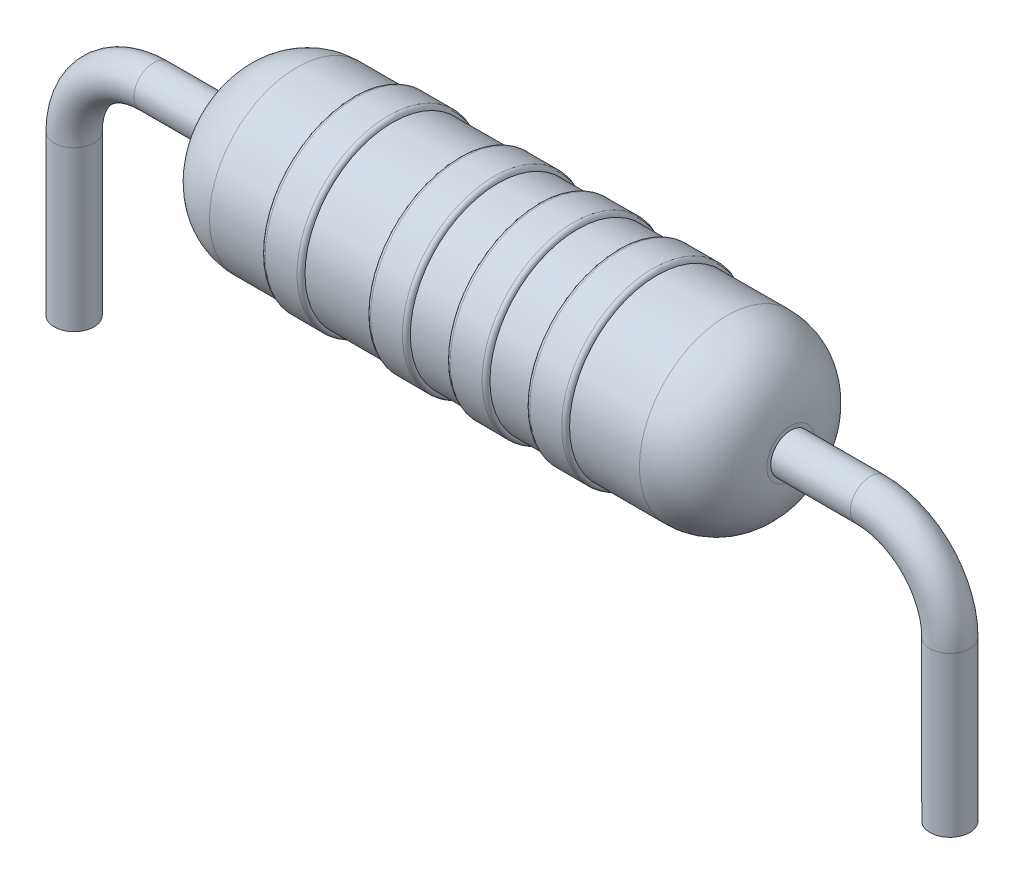
ISO-10303-21;
HEADER;
FILE_DESCRIPTION(('STEP AP214'),'2;1');
FILE_NAME('part.step','',(''),(''),'','','');
FILE_SCHEMA(('AUTOMOTIVE_DESIGN { 1 0 10303 214 1 1 1 1 }'));
ENDSEC;
DATA;
#1=APPLICATION_CONTEXT('core data for automotive mechanical design processes');
#2=APPLICATION_PROTOCOL_DEFINITION('international standard','automotive_design',2000,#1);
#3=PRODUCT_CONTEXT('',#1,'mechanical');
#4=PRODUCT('Part','Part','',(#3));
#5=PRODUCT_RELATED_PRODUCT_CATEGORY('part','',(#4));
#6=PRODUCT_DEFINITION_FORMATION('','',#4);
#7=PRODUCT_DEFINITION_CONTEXT('part definition',#1,'design');
#8=PRODUCT_DEFINITION('design','',#6,#7);
#9=PRODUCT_DEFINITION_SHAPE('','',#8);
#10=(LENGTH_UNIT() NAMED_UNIT(*) SI_UNIT(.MILLI.,.METRE.));
#11=(NAMED_UNIT(*) PLANE_ANGLE_UNIT() SI_UNIT($,.RADIAN.));
#12=(NAMED_UNIT(*) SI_UNIT($,.STERADIAN.) SOLID_ANGLE_UNIT());
#13=UNCERTAINTY_MEASURE_WITH_UNIT(LENGTH_MEASURE(1.E-05),#10,'distance_accuracy_value','');
#14=(GEOMETRIC_REPRESENTATION_CONTEXT(3) GLOBAL_UNCERTAINTY_ASSIGNED_CONTEXT((#13)) GLOBAL_UNIT_ASSIGNED_CONTEXT((#10,
#11,#12)) REPRESENTATION_CONTEXT('',''));
#15=CARTESIAN_POINT('',(0.,0.,0.));
#16=DIRECTION('',(0.,0.,1.));
#17=DIRECTION('',(1.,0.,0.));
#18=AXIS2_PLACEMENT_3D('',#15,#16,#17);
#19=CARTESIAN_POINT('',(-3.5,0.,0.));
#20=DIRECTION('',(1.,0.,0.));
#21=DIRECTION('',(0.,0.,-1.));
#22=AXIS2_PLACEMENT_3D('',#19,#20,#21);
#23=PLANE('',#22);
#24=CARTESIAN_POINT('',(-3.5,0.,0.));
#25=DIRECTION('',(-1.,0.,0.));
#26=DIRECTION('',(0.,0.,1.));
#27=AXIS2_PLACEMENT_3D('',#24,#25,#26);
#28=CIRCLE('',#27,0.299999999999995);
#29=CARTESIAN_POINT('',(-3.5,0.,0.299999999999995));
#30=VERTEX_POINT('',#29);
#31=EDGE_CURVE('E91',#30,#30,#28,.T.);
#32=ORIENTED_EDGE('',*,*,#31,.T.);
#33=EDGE_LOOP('',(#32));
#34=FACE_BOUND('',#33,.T.);
#35=CARTESIAN_POINT('',(-3.5,0.,0.));
#36=DIRECTION('',(1.,0.,0.));
#37=DIRECTION('',(0.,0.,-1.));
#38=AXIS2_PLACEMENT_3D('',#35,#36,#37);
#39=CIRCLE('',#38,0.25);
#40=CARTESIAN_POINT('',(-3.5,0.,-0.25));
#41=VERTEX_POINT('',#40);
#42=EDGE_CURVE('E10',#41,#41,#39,.F.);
#43=ORIENTED_EDGE('',*,*,#42,.F.);
#44=EDGE_LOOP('',(#43));
#45=FACE_BOUND('',#44,.T.);
#46=ADVANCED_FACE('F32',(#34,#45),#23,.F.);
#47=CARTESIAN_POINT('',(-54.2686615886834,0.,0.));
#48=DIRECTION('',(-1.,0.,0.));
#49=DIRECTION('',(0.,0.,1.));
#50=AXIS2_PLACEMENT_3D('',#47,#48,#49);
#51=CYLINDRICAL_SURFACE('',#50,1.1);
#52=CARTESIAN_POINT('',(0.322975145638588,0.,0.));
#53=DIRECTION('',(-1.,0.,0.));
#54=DIRECTION('',(0.,0.,1.));
#55=AXIS2_PLACEMENT_3D('',#52,#53,#54);
#56=CIRCLE('',#55,1.1);
#57=CARTESIAN_POINT('',(0.322975145638588,0.,1.1));
#58=VERTEX_POINT('',#57);
#59=EDGE_CURVE('E79',#58,#58,#56,.T.);
#60=ORIENTED_EDGE('',*,*,#59,.T.);
#61=EDGE_LOOP('',(#60));
#62=FACE_BOUND('',#61,.T.);
#63=CARTESIAN_POINT('',(-0.177024854361413,0.,0.));
#64=DIRECTION('',(1.,0.,0.));
#65=DIRECTION('',(0.,0.,-1.));
#66=AXIS2_PLACEMENT_3D('',#63,#64,#65);
#67=CIRCLE('',#66,1.1);
#68=CARTESIAN_POINT('',(-0.177024854361413,0.,-1.1));
#69=VERTEX_POINT('',#68);
#70=EDGE_CURVE('E88',#69,#69,#67,.T.);
#71=ORIENTED_EDGE('',*,*,#70,.T.);
#72=EDGE_LOOP('',(#71));
#73=FACE_BOUND('',#72,.T.);
#74=ADVANCED_FACE('F149',(#62,#73),#51,.T.);
#75=CARTESIAN_POINT('',(4.3261723446646,0.,0.));
#76=DIRECTION('',(1.,0.,0.));
#77=DIRECTION('',(0.,0.,-1.));
#78=AXIS2_PLACEMENT_3D('',#75,#76,#77);
#79=CYLINDRICAL_SURFACE('',#78,1.15);
#80=CARTESIAN_POINT('',(-0.627024854361413,0.,0.));
#81=DIRECTION('',(-1.,0.,0.));
#82=DIRECTION('',(0.,0.,1.));
#83=AXIS2_PLACEMENT_3D('',#80,#81,#82);
#84=CIRCLE('',#83,1.15);
#85=CARTESIAN_POINT('',(-0.627024854361413,0.,1.15));
#86=VERTEX_POINT('',#85);
#87=EDGE_CURVE('E55',#86,#86,#84,.F.);
#88=ORIENTED_EDGE('',*,*,#87,.T.);
#89=EDGE_LOOP('',(#88));
#90=FACE_BOUND('',#89,.T.);
#91=CARTESIAN_POINT('',(-0.227024854361413,0.,0.));
#92=DIRECTION('',(1.,0.,0.));
#93=DIRECTION('',(0.,0.,-1.));
#94=AXIS2_PLACEMENT_3D('',#91,#92,#93);
#95=CIRCLE('',#94,1.15);
#96=CARTESIAN_POINT('',(-0.227024854361413,0.,-1.15));
#97=VERTEX_POINT('',#96);
#98=EDGE_CURVE('E58',#97,#97,#95,.F.);
#99=ORIENTED_EDGE('',*,*,#98,.T.);
#100=EDGE_LOOP('',(#99));
#101=FACE_BOUND('',#100,.T.);
#102=ADVANCED_FACE('F155',(#90,#101),#79,.T.);
#103=CARTESIAN_POINT('',(-1.5,0.,0.));
#104=DIRECTION('',(1.,0.,0.));
#105=DIRECTION('',(0.,0.,-1.));
#106=AXIS2_PLACEMENT_3D('',#103,#104,#105);
#107=CIRCLE('',#106,1.1);
#108=CARTESIAN_POINT('',(-1.5,0.,-1.1));
#109=VERTEX_POINT('',#108);
#110=EDGE_CURVE('E72',#109,#109,#107,.T.);
#111=ORIENTED_EDGE('',*,*,#110,.T.);
#112=EDGE_LOOP('',(#111));
#113=FACE_BOUND('',#112,.T.);
#114=CARTESIAN_POINT('',(-0.677024854361413,0.,0.));
#115=DIRECTION('',(-1.,0.,0.));
#116=DIRECTION('',(0.,0.,1.));
#117=AXIS2_PLACEMENT_3D('',#114,#115,#116);
#118=CIRCLE('',#117,1.1);
#119=CARTESIAN_POINT('',(-0.677024854361413,0.,1.1));
#120=VERTEX_POINT('',#119);
#121=EDGE_CURVE('E85',#120,#120,#118,.T.);
#122=ORIENTED_EDGE('',*,*,#121,.T.);
#123=EDGE_LOOP('',(#122));
#124=FACE_BOUND('',#123,.T.);
#125=ADVANCED_FACE('F158',(#113,#124),#51,.T.);
#126=CARTESIAN_POINT('',(4.3261723446646,0.,0.));
#127=DIRECTION('',(1.,0.,0.));
#128=DIRECTION('',(0.,0.,-1.));
#129=AXIS2_PLACEMENT_3D('',#126,#127,#128);
#130=CYLINDRICAL_SURFACE('',#129,1.15);
#131=CARTESIAN_POINT('',(0.372975145638587,0.,0.));
#132=DIRECTION('',(-1.,0.,0.));
#133=DIRECTION('',(0.,0.,1.));
#134=AXIS2_PLACEMENT_3D('',#131,#132,#133);
#135=CIRCLE('',#134,1.15);
#136=CARTESIAN_POINT('',(0.372975145638587,0.,1.15));
#137=VERTEX_POINT('',#136);
#138=EDGE_CURVE('E47',#137,#137,#135,.F.);
#139=ORIENTED_EDGE('',*,*,#138,.T.);
#140=EDGE_LOOP('',(#139));
#141=FACE_BOUND('',#140,.T.);
#142=CARTESIAN_POINT('',(0.772975145638587,0.,0.));
#143=DIRECTION('',(1.,0.,0.));
#144=DIRECTION('',(0.,0.,-1.));
#145=AXIS2_PLACEMENT_3D('',#142,#143,#144);
#146=CIRCLE('',#145,1.15);
#147=CARTESIAN_POINT('',(0.772975145638587,0.,-1.15));
#148=VERTEX_POINT('',#147);
#149=EDGE_CURVE('E52',#148,#148,#146,.F.);
#150=ORIENTED_EDGE('',*,*,#149,.T.);
#151=EDGE_LOOP('',(#150));
#152=FACE_BOUND('',#151,.T.);
#153=ADVANCED_FACE('F171',(#141,#152),#130,.T.);
#154=CARTESIAN_POINT('',(1.32297514563859,0.,0.));
#155=DIRECTION('',(-1.,0.,0.));
#156=DIRECTION('',(0.,0.,1.));
#157=AXIS2_PLACEMENT_3D('',#154,#155,#156);
#158=CIRCLE('',#157,1.1);
#159=CARTESIAN_POINT('',(1.32297514563859,0.,1.1));
#160=VERTEX_POINT('',#159);
#161=EDGE_CURVE('E71',#160,#160,#158,.T.);
#162=ORIENTED_EDGE('',*,*,#161,.T.);
#163=EDGE_LOOP('',(#162));
#164=FACE_BOUND('',#163,.T.);
#165=CARTESIAN_POINT('',(0.822975145638588,0.,0.));
#166=DIRECTION('',(1.,0.,0.));
#167=DIRECTION('',(0.,0.,-1.));
#168=AXIS2_PLACEMENT_3D('',#165,#166,#167);
#169=CIRCLE('',#168,1.1);
#170=CARTESIAN_POINT('',(0.822975145638588,0.,-1.1));
#171=VERTEX_POINT('',#170);
#172=EDGE_CURVE('E82',#171,#171,#169,.T.);
#173=ORIENTED_EDGE('',*,*,#172,.T.);
#174=EDGE_LOOP('',(#173));
#175=FACE_BOUND('',#174,.T.);
#176=ADVANCED_FACE('F159',(#164,#175),#51,.T.);
#177=CARTESIAN_POINT('',(4.3261723446646,0.,0.));
#178=DIRECTION('',(1.,0.,0.));
#179=DIRECTION('',(0.,0.,-1.));
#180=AXIS2_PLACEMENT_3D('',#177,#178,#179);
#181=CYLINDRICAL_SURFACE('',#180,1.15);
#182=CARTESIAN_POINT('',(1.37297514563859,0.,0.));
#183=DIRECTION('',(-1.,0.,0.));
#184=DIRECTION('',(0.,0.,1.));
#185=AXIS2_PLACEMENT_3D('',#182,#183,#184);
#186=CIRCLE('',#185,1.15);
#187=CARTESIAN_POINT('',(1.37297514563859,0.,1.15));
#188=VERTEX_POINT('',#187);
#189=EDGE_CURVE('E39',#188,#188,#186,.F.);
#190=ORIENTED_EDGE('',*,*,#189,.T.);
#191=EDGE_LOOP('',(#190));
#192=FACE_BOUND('',#191,.T.);
#193=CARTESIAN_POINT('',(1.77297514563859,0.,0.));
#194=DIRECTION('',(1.,0.,0.));
#195=DIRECTION('',(0.,0.,-1.));
#196=AXIS2_PLACEMENT_3D('',#193,#194,#195);
#197=CIRCLE('',#196,1.15);
#198=CARTESIAN_POINT('',(1.77297514563859,0.,-1.15));
#199=VERTEX_POINT('',#198);
#200=EDGE_CURVE('E43',#199,#199,#197,.F.);
#201=ORIENTED_EDGE('',*,*,#200,.T.);
#202=EDGE_LOOP('',(#201));
#203=FACE_BOUND('',#202,.T.);
#204=ADVANCED_FACE('F181',(#192,#203),#181,.T.);
#205=CARTESIAN_POINT('',(3.5,0.299999999999995,0.));
#206=DIRECTION('',(-1.,0.,0.));
#207=DIRECTION('',(0.,0.,1.));
#208=AXIS2_PLACEMENT_3D('',#205,#206,#207);
#209=PLANE('',#208);
#210=CARTESIAN_POINT('',(3.5,0.,0.));
#211=DIRECTION('',(-1.,0.,0.));
#212=DIRECTION('',(0.,0.,1.));
#213=AXIS2_PLACEMENT_3D('',#210,#211,#212);
#214=CIRCLE('',#213,0.25);
#215=CARTESIAN_POINT('',(3.5,0.,0.25));
#216=VERTEX_POINT('',#215);
#217=EDGE_CURVE('E119',#216,#216,#214,.T.);
#218=ORIENTED_EDGE('',*,*,#217,.T.);
#219=EDGE_LOOP('',(#218));
#220=FACE_BOUND('',#219,.T.);
#221=CARTESIAN_POINT('',(3.5,0.,0.));
#222=DIRECTION('',(-1.,0.,0.));
#223=DIRECTION('',(0.,0.,1.));
#224=AXIS2_PLACEMENT_3D('',#221,#222,#223);
#225=CIRCLE('',#224,0.299999999999995);
#226=CARTESIAN_POINT('',(3.5,0.,0.299999999999995));
#227=VERTEX_POINT('',#226);
#228=EDGE_CURVE('E67',#227,#227,#225,.T.);
#229=ORIENTED_EDGE('',*,*,#228,.F.);
#230=EDGE_LOOP('',(#229));
#231=FACE_BOUND('',#230,.T.);
#232=ADVANCED_FACE('F177',(#220,#231),#209,.F.);
#233=CARTESIAN_POINT('',(2.7,0.,0.));
#234=DIRECTION('',(-1.,0.,0.));
#235=DIRECTION('',(0.,0.,1.));
#236=AXIS2_PLACEMENT_3D('',#233,#234,#235);
#237=DEGENERATE_TOROIDAL_SURFACE('',#236,0.3,0.8,.T.);
#238=CARTESIAN_POINT('',(2.69999999999999,0.,0.));
#239=DIRECTION('',(-1.,0.,0.));
#240=DIRECTION('',(0.,0.,1.));
#241=AXIS2_PLACEMENT_3D('',#238,#239,#240);
#242=CIRCLE('',#241,1.1);
#243=CARTESIAN_POINT('',(2.69999999999999,0.,1.1));
#244=VERTEX_POINT('',#243);
#245=EDGE_CURVE('E96',#244,#244,#242,.T.);
#246=ORIENTED_EDGE('',*,*,#245,.F.);
#247=EDGE_LOOP('',(#246));
#248=FACE_BOUND('',#247,.T.);
#249=ORIENTED_EDGE('',*,*,#228,.T.);
#250=EDGE_LOOP('',(#249));
#251=FACE_BOUND('',#250,.T.);
#252=ADVANCED_FACE('F173',(#248,#251),#237,.T.);
#253=CARTESIAN_POINT('',(1.82297514563859,0.,0.));
#254=DIRECTION('',(1.,0.,0.));
#255=DIRECTION('',(0.,0.,-1.));
#256=AXIS2_PLACEMENT_3D('',#253,#254,#255);
#257=CIRCLE('',#256,1.1);
#258=CARTESIAN_POINT('',(1.82297514563859,0.,-1.1));
#259=VERTEX_POINT('',#258);
#260=EDGE_CURVE('E76',#259,#259,#257,.T.);
#261=ORIENTED_EDGE('',*,*,#260,.T.);
#262=EDGE_LOOP('',(#261));
#263=FACE_BOUND('',#262,.T.);
#264=ORIENTED_EDGE('',*,*,#245,.T.);
#265=EDGE_LOOP('',(#264));
#266=FACE_BOUND('',#265,.T.);
#267=ADVANCED_FACE('F176',(#263,#266),#51,.T.);
#268=CARTESIAN_POINT('',(4.3261723446646,0.,0.));
#269=DIRECTION('',(1.,0.,0.));
#270=DIRECTION('',(0.,0.,-1.));
#271=AXIS2_PLACEMENT_3D('',#268,#269,#270);
#272=CYLINDRICAL_SURFACE('',#271,1.15);
#273=CARTESIAN_POINT('',(-1.95,0.,0.));
#274=DIRECTION('',(-1.,0.,0.));
#275=DIRECTION('',(0.,0.,1.));
#276=AXIS2_PLACEMENT_3D('',#273,#274,#275);
#277=CIRCLE('',#276,1.15);
#278=CARTESIAN_POINT('',(-1.95,0.,1.15));
#279=VERTEX_POINT('',#278);
#280=EDGE_CURVE('E61',#279,#279,#277,.F.);
#281=ORIENTED_EDGE('',*,*,#280,.T.);
#282=EDGE_LOOP('',(#281));
#283=FACE_BOUND('',#282,.T.);
#284=CARTESIAN_POINT('',(-1.55,0.,0.));
#285=DIRECTION('',(1.,0.,0.));
#286=DIRECTION('',(0.,0.,-1.));
#287=AXIS2_PLACEMENT_3D('',#284,#285,#286);
#288=CIRCLE('',#287,1.15);
#289=CARTESIAN_POINT('',(-1.55,0.,-1.15));
#290=VERTEX_POINT('',#289);
#291=EDGE_CURVE('E64',#290,#290,#288,.F.);
#292=ORIENTED_EDGE('',*,*,#291,.T.);
#293=EDGE_LOOP('',(#292));
#294=FACE_BOUND('',#293,.T.);
#295=ADVANCED_FACE('F167',(#283,#294),#272,.T.);
#296=CARTESIAN_POINT('',(-2.7,0.,0.));
#297=DIRECTION('',(-1.,0.,0.));
#298=DIRECTION('',(0.,0.,1.));
#299=AXIS2_PLACEMENT_3D('',#296,#297,#298);
#300=DEGENERATE_TOROIDAL_SURFACE('',#299,0.3,0.8,.T.);
#301=ORIENTED_EDGE('',*,*,#31,.F.);
#302=EDGE_LOOP('',(#301));
#303=FACE_BOUND('',#302,.T.);
#304=CARTESIAN_POINT('',(-2.69999999999999,0.,0.));
#305=DIRECTION('',(-1.,0.,0.));
#306=DIRECTION('',(0.,0.,1.));
#307=AXIS2_PLACEMENT_3D('',#304,#305,#306);
#308=CIRCLE('',#307,1.1);
#309=CARTESIAN_POINT('',(-2.69999999999999,0.,1.1));
#310=VERTEX_POINT('',#309);
#311=EDGE_CURVE('E99',#310,#310,#308,.T.);
#312=ORIENTED_EDGE('',*,*,#311,.T.);
#313=EDGE_LOOP('',(#312));
#314=FACE_BOUND('',#313,.T.);
#315=ADVANCED_FACE('F164',(#303,#314),#300,.T.);
#316=CARTESIAN_POINT('',(-2.,0.,0.));
#317=DIRECTION('',(-1.,0.,0.));
#318=DIRECTION('',(0.,0.,1.));
#319=AXIS2_PLACEMENT_3D('',#316,#317,#318);
#320=CIRCLE('',#319,1.1);
#321=CARTESIAN_POINT('',(-2.,0.,1.1));
#322=VERTEX_POINT('',#321);
#323=EDGE_CURVE('E68',#322,#322,#320,.T.);
#324=ORIENTED_EDGE('',*,*,#323,.T.);
#325=EDGE_LOOP('',(#324));
#326=FACE_BOUND('',#325,.T.);
#327=ORIENTED_EDGE('',*,*,#311,.F.);
#328=EDGE_LOOP('',(#327));
#329=FACE_BOUND('',#328,.T.);
#330=ADVANCED_FACE('F166',(#326,#329),#51,.T.);
#331=CARTESIAN_POINT('',(-1.95,0.,0.));
#332=DIRECTION('',(-1.,0.,0.));
#333=DIRECTION('',(0.,0.,1.));
#334=AXIS2_PLACEMENT_3D('',#331,#332,#333);
#335=TOROIDAL_SURFACE('',#334,1.1,0.05);
#336=ORIENTED_EDGE('',*,*,#323,.F.);
#337=EDGE_LOOP('',(#336));
#338=FACE_BOUND('',#337,.T.);
#339=ORIENTED_EDGE('',*,*,#280,.F.);
#340=EDGE_LOOP('',(#339));
#341=FACE_BOUND('',#340,.T.);
#342=ADVANCED_FACE('F183',(#338,#341),#335,.T.);
#343=CARTESIAN_POINT('',(-1.55,0.,0.));
#344=DIRECTION('',(1.,0.,0.));
#345=DIRECTION('',(0.,0.,-1.));
#346=AXIS2_PLACEMENT_3D('',#343,#344,#345);
#347=TOROIDAL_SURFACE('',#346,1.1,0.05);
#348=ORIENTED_EDGE('',*,*,#291,.F.);
#349=EDGE_LOOP('',(#348));
#350=FACE_BOUND('',#349,.T.);
#351=ORIENTED_EDGE('',*,*,#110,.F.);
#352=EDGE_LOOP('',(#351));
#353=FACE_BOUND('',#352,.T.);
#354=ADVANCED_FACE('F186',(#350,#353),#347,.T.);
#355=CARTESIAN_POINT('',(-0.627024854361413,0.,0.));
#356=DIRECTION('',(-1.,0.,0.));
#357=DIRECTION('',(0.,0.,1.));
#358=AXIS2_PLACEMENT_3D('',#355,#356,#357);
#359=TOROIDAL_SURFACE('',#358,1.1,0.05);
#360=ORIENTED_EDGE('',*,*,#121,.F.);
#361=EDGE_LOOP('',(#360));
#362=FACE_BOUND('',#361,.T.);
#363=ORIENTED_EDGE('',*,*,#87,.F.);
#364=EDGE_LOOP('',(#363));
#365=FACE_BOUND('',#364,.T.);
#366=ADVANCED_FACE('F190',(#362,#365),#359,.T.);
#367=CARTESIAN_POINT('',(-0.227024854361413,0.,0.));
#368=DIRECTION('',(1.,0.,0.));
#369=DIRECTION('',(0.,0.,-1.));
#370=AXIS2_PLACEMENT_3D('',#367,#368,#369);
#371=TOROIDAL_SURFACE('',#370,1.1,0.05);
#372=ORIENTED_EDGE('',*,*,#98,.F.);
#373=EDGE_LOOP('',(#372));
#374=FACE_BOUND('',#373,.T.);
#375=ORIENTED_EDGE('',*,*,#70,.F.);
#376=EDGE_LOOP('',(#375));
#377=FACE_BOUND('',#376,.T.);
#378=ADVANCED_FACE('F194',(#374,#377),#371,.T.);
#379=CARTESIAN_POINT('',(0.372975145638587,0.,0.));
#380=DIRECTION('',(-1.,0.,0.));
#381=DIRECTION('',(0.,0.,1.));
#382=AXIS2_PLACEMENT_3D('',#379,#380,#381);
#383=TOROIDAL_SURFACE('',#382,1.1,0.05);
#384=ORIENTED_EDGE('',*,*,#59,.F.);
#385=EDGE_LOOP('',(#384));
#386=FACE_BOUND('',#385,.T.);
#387=ORIENTED_EDGE('',*,*,#138,.F.);
#388=EDGE_LOOP('',(#387));
#389=FACE_BOUND('',#388,.T.);
#390=ADVANCED_FACE('F198',(#386,#389),#383,.T.);
#391=CARTESIAN_POINT('',(0.772975145638587,0.,0.));
#392=DIRECTION('',(1.,0.,0.));
#393=DIRECTION('',(0.,0.,-1.));
#394=AXIS2_PLACEMENT_3D('',#391,#392,#393);
#395=TOROIDAL_SURFACE('',#394,1.1,0.05);
#396=ORIENTED_EDGE('',*,*,#149,.F.);
#397=EDGE_LOOP('',(#396));
#398=FACE_BOUND('',#397,.T.);
#399=ORIENTED_EDGE('',*,*,#172,.F.);
#400=EDGE_LOOP('',(#399));
#401=FACE_BOUND('',#400,.T.);
#402=ADVANCED_FACE('F202',(#398,#401),#395,.T.);
#403=CARTESIAN_POINT('',(1.37297514563859,0.,0.));
#404=DIRECTION('',(-1.,0.,0.));
#405=DIRECTION('',(0.,0.,1.));
#406=AXIS2_PLACEMENT_3D('',#403,#404,#405);
#407=TOROIDAL_SURFACE('',#406,1.1,0.05);
#408=ORIENTED_EDGE('',*,*,#161,.F.);
#409=EDGE_LOOP('',(#408));
#410=FACE_BOUND('',#409,.T.);
#411=ORIENTED_EDGE('',*,*,#189,.F.);
#412=EDGE_LOOP('',(#411));
#413=FACE_BOUND('',#412,.T.);
#414=ADVANCED_FACE('F205',(#410,#413),#407,.T.);
#415=CARTESIAN_POINT('',(1.77297514563859,0.,0.));
#416=DIRECTION('',(1.,0.,0.));
#417=DIRECTION('',(0.,0.,-1.));
#418=AXIS2_PLACEMENT_3D('',#415,#416,#417);
#419=TOROIDAL_SURFACE('',#418,1.1,0.05);
#420=ORIENTED_EDGE('',*,*,#200,.F.);
#421=EDGE_LOOP('',(#420));
#422=FACE_BOUND('',#421,.T.);
#423=ORIENTED_EDGE('',*,*,#260,.F.);
#424=EDGE_LOOP('',(#423));
#425=FACE_BOUND('',#424,.T.);
#426=ADVANCED_FACE('F34',(#422,#425),#419,.T.);
#427=CARTESIAN_POINT('',(-5.5,-1.00000000000001,0.));
#428=DIRECTION('',(0.,-1.,0.));
#429=DIRECTION('',(0.,0.,-1.));
#430=AXIS2_PLACEMENT_3D('',#427,#428,#429);
#431=CYLINDRICAL_SURFACE('',#430,0.25);
#432=CARTESIAN_POINT('',(-5.5,-1.00000000000001,0.));
#433=DIRECTION('',(0.,-1.,0.));
#434=DIRECTION('',(0.,0.,1.));
#435=AXIS2_PLACEMENT_3D('',#432,#433,#434);
#436=CIRCLE('',#435,0.25);
#437=CARTESIAN_POINT('',(-5.75,-1.00000000000001,0.));
#438=VERTEX_POINT('',#437);
#439=EDGE_CURVE('E106',#438,#438,#436,.T.);
#440=ORIENTED_EDGE('',*,*,#439,.T.);
#441=EDGE_LOOP('',(#440));
#442=FACE_BOUND('',#441,.T.);
#443=CARTESIAN_POINT('',(-5.5,-3.,0.));
#444=DIRECTION('',(0.,-1.,0.));
#445=DIRECTION('',(0.,0.,1.));
#446=AXIS2_PLACEMENT_3D('',#443,#444,#445);
#447=CIRCLE('',#446,0.25);
#448=CARTESIAN_POINT('',(-5.5,-3.,0.25));
#449=VERTEX_POINT('',#448);
#450=EDGE_CURVE('E75',#449,#449,#447,.T.);
#451=ORIENTED_EDGE('',*,*,#450,.F.);
#452=EDGE_LOOP('',(#451));
#453=FACE_BOUND('',#452,.T.);
#454=ADVANCED_FACE('F212',(#442,#453),#431,.T.);
#455=CARTESIAN_POINT('',(-4.5,-1.,0.));
#456=DIRECTION('',(0.,0.,1.));
#457=DIRECTION('',(1.,0.,0.));
#458=AXIS2_PLACEMENT_3D('',#455,#456,#457);
#459=TOROIDAL_SURFACE('',#458,1.,0.25);
#460=CARTESIAN_POINT('',(-4.49999999999999,0.,0.));
#461=DIRECTION('',(-1.,0.,0.));
#462=DIRECTION('',(0.,0.,1.));
#463=AXIS2_PLACEMENT_3D('',#460,#461,#462);
#464=CIRCLE('',#463,0.25);
#465=CARTESIAN_POINT('',(-4.49999999999999,0.25,0.));
#466=VERTEX_POINT('',#465);
#467=EDGE_CURVE('E109',#466,#466,#464,.T.);
#468=CARTESIAN_POINT('',(-4.5,-1.,0.));
#469=DIRECTION('',(0.,0.,1.));
#470=DIRECTION('',(1.,0.,0.));
#471=AXIS2_PLACEMENT_3D('',#468,#469,#470);
#472=CIRCLE('',#471,1.25);
#473=EDGE_CURVE('',#466,#438,#472,.T.);
#474=ORIENTED_EDGE('',*,*,#467,.T.);
#475=ORIENTED_EDGE('',*,*,#439,.F.);
#476=ORIENTED_EDGE('',*,*,#473,.T.);
#477=ORIENTED_EDGE('',*,*,#473,.F.);
#478=EDGE_LOOP('',(#474,#476,#475,#477));
#479=FACE_BOUND('',#478,.T.);
#480=ADVANCED_FACE('F358',(#479),#459,.T.);
#481=CARTESIAN_POINT('',(-4.49999999999999,0.,0.));
#482=DIRECTION('',(1.,0.,0.));
#483=DIRECTION('',(0.,0.,-1.));
#484=AXIS2_PLACEMENT_3D('',#481,#482,#483);
#485=CYLINDRICAL_SURFACE('',#484,0.25);
#486=ORIENTED_EDGE('',*,*,#467,.F.);
#487=EDGE_LOOP('',(#486));
#488=FACE_BOUND('',#487,.T.);
#489=ORIENTED_EDGE('',*,*,#42,.T.);
#490=EDGE_LOOP('',(#489));
#491=FACE_BOUND('',#490,.T.);
#492=ADVANCED_FACE('F367',(#488,#491),#485,.T.);
#493=CARTESIAN_POINT('',(-5.5,-3.,0.));
#494=DIRECTION('',(0.,-1.,0.));
#495=DIRECTION('',(0.,0.,1.));
#496=AXIS2_PLACEMENT_3D('',#493,#494,#495);
#497=PLANE('',#496);
#498=ORIENTED_EDGE('',*,*,#450,.T.);
#499=EDGE_LOOP('',(#498));
#500=FACE_BOUND('',#499,.T.);
#501=ADVANCED_FACE('F137',(#500),#497,.T.);
#502=CARTESIAN_POINT('',(5.5,-1.00000000000001,0.));
#503=DIRECTION('',(0.,-1.,0.));
#504=DIRECTION('',(0.,0.,-1.));
#505=AXIS2_PLACEMENT_3D('',#502,#503,#504);
#506=CYLINDRICAL_SURFACE('',#505,0.25);
#507=CARTESIAN_POINT('',(5.5,-1.00000000000001,0.));
#508=DIRECTION('',(0.,1.,0.));
#509=DIRECTION('',(0.,0.,1.));
#510=AXIS2_PLACEMENT_3D('',#507,#508,#509);
#511=CIRCLE('',#510,0.25);
#512=CARTESIAN_POINT('',(5.75,-1.00000000000001,0.));
#513=VERTEX_POINT('',#512);
#514=EDGE_CURVE('E115',#513,#513,#511,.T.);
#515=ORIENTED_EDGE('',*,*,#514,.F.);
#516=EDGE_LOOP('',(#515));
#517=FACE_BOUND('',#516,.T.);
#518=CARTESIAN_POINT('',(5.5,-3.,0.));
#519=DIRECTION('',(0.,1.,0.));
#520=DIRECTION('',(0.,0.,1.));
#521=AXIS2_PLACEMENT_3D('',#518,#519,#520);
#522=CIRCLE('',#521,0.25);
#523=CARTESIAN_POINT('',(5.5,-3.,0.25));
#524=VERTEX_POINT('',#523);
#525=EDGE_CURVE('E112',#524,#524,#522,.T.);
#526=ORIENTED_EDGE('',*,*,#525,.T.);
#527=EDGE_LOOP('',(#526));
#528=FACE_BOUND('',#527,.T.);
#529=ADVANCED_FACE('F131',(#517,#528),#506,.T.);
#530=CARTESIAN_POINT('',(4.5,-1.,0.));
#531=DIRECTION('',(0.,0.,-1.));
#532=DIRECTION('',(-1.,0.,0.));
#533=AXIS2_PLACEMENT_3D('',#530,#531,#532);
#534=TOROIDAL_SURFACE('',#533,1.,0.25);
#535=CARTESIAN_POINT('',(4.49999999999999,0.,0.));
#536=DIRECTION('',(-1.,0.,0.));
#537=DIRECTION('',(0.,0.,1.));
#538=AXIS2_PLACEMENT_3D('',#535,#536,#537);
#539=CIRCLE('',#538,0.25);
#540=CARTESIAN_POINT('',(4.49999999999999,0.25,0.));
#541=VERTEX_POINT('',#540);
#542=EDGE_CURVE('E118',#541,#541,#539,.T.);
#543=CARTESIAN_POINT('',(4.5,-1.,0.));
#544=DIRECTION('',(0.,0.,-1.));
#545=DIRECTION('',(-1.,0.,0.));
#546=AXIS2_PLACEMENT_3D('',#543,#544,#545);
#547=CIRCLE('',#546,1.25);
#548=EDGE_CURVE('',#541,#513,#547,.T.);
#549=ORIENTED_EDGE('',*,*,#542,.F.);
#550=ORIENTED_EDGE('',*,*,#514,.T.);
#551=ORIENTED_EDGE('',*,*,#548,.T.);
#552=ORIENTED_EDGE('',*,*,#548,.F.);
#553=EDGE_LOOP('',(#549,#551,#550,#552));
#554=FACE_BOUND('',#553,.T.);
#555=ADVANCED_FACE('F128',(#554),#534,.T.);
#556=CARTESIAN_POINT('',(4.49999999999999,0.,0.));
#557=DIRECTION('',(-1.,0.,0.));
#558=DIRECTION('',(0.,0.,1.));
#559=AXIS2_PLACEMENT_3D('',#556,#557,#558);
#560=CYLINDRICAL_SURFACE('',#559,0.25);
#561=ORIENTED_EDGE('',*,*,#542,.T.);
#562=EDGE_LOOP('',(#561));
#563=FACE_BOUND('',#562,.T.);
#564=ORIENTED_EDGE('',*,*,#217,.F.);
#565=EDGE_LOOP('',(#564));
#566=FACE_BOUND('',#565,.T.);
#567=ADVANCED_FACE('F125',(#563,#566),#560,.T.);
#568=CARTESIAN_POINT('',(5.5,-3.,0.));
#569=DIRECTION('',(0.,-1.,0.));
#570=DIRECTION('',(0.,0.,1.));
#571=AXIS2_PLACEMENT_3D('',#568,#569,#570);
#572=PLANE('',#571);
#573=ORIENTED_EDGE('',*,*,#525,.F.);
#574=EDGE_LOOP('',(#573));
#575=FACE_BOUND('',#574,.T.);
#576=ADVANCED_FACE('F141',(#575),#572,.T.);
#577=CLOSED_SHELL('',(#46,#74,#102,#125,#153,#176,#204,#232,#252,#267,#295,#315,#330,#342,#354,
#366,#378,#390,#402,#414,#426,#454,#480,#492,#501,#529,#555,#567,#576));
#578=MANIFOLD_SOLID_BREP('B2',#577);
#579=ADVANCED_BREP_SHAPE_REPRESENTATION('',(#18,#578),#14);
#580=SHAPE_DEFINITION_REPRESENTATION(#9,#579);
ENDSEC;
END-ISO-10303-21;
